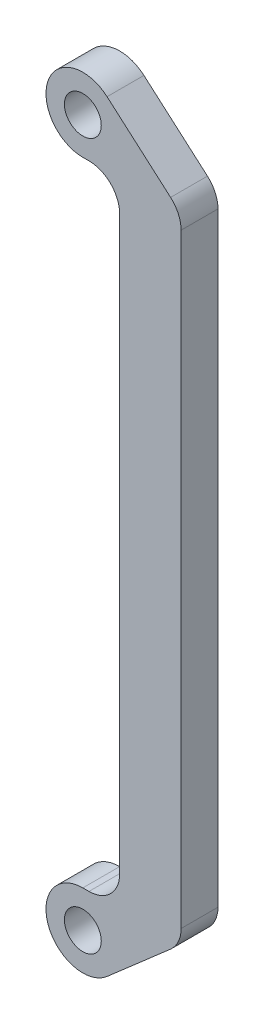
ISO-10303-21;
HEADER;
FILE_DESCRIPTION(('STEP AP214'),'2;1');
FILE_NAME('part.step','',(''),(''),'','','');
FILE_SCHEMA(('AUTOMOTIVE_DESIGN { 1 0 10303 214 1 1 1 1 }'));
ENDSEC;
DATA;
#1=APPLICATION_CONTEXT('core data for automotive mechanical design processes');
#2=APPLICATION_PROTOCOL_DEFINITION('international standard','automotive_design',2000,#1);
#3=PRODUCT_CONTEXT('',#1,'mechanical');
#4=PRODUCT('Part','Part','',(#3));
#5=PRODUCT_RELATED_PRODUCT_CATEGORY('part','',(#4));
#6=PRODUCT_DEFINITION_FORMATION('','',#4);
#7=PRODUCT_DEFINITION_CONTEXT('part definition',#1,'design');
#8=PRODUCT_DEFINITION('design','',#6,#7);
#9=PRODUCT_DEFINITION_SHAPE('','',#8);
#10=(LENGTH_UNIT() NAMED_UNIT(*) SI_UNIT(.MILLI.,.METRE.));
#11=(NAMED_UNIT(*) PLANE_ANGLE_UNIT() SI_UNIT($,.RADIAN.));
#12=(NAMED_UNIT(*) SI_UNIT($,.STERADIAN.) SOLID_ANGLE_UNIT());
#13=UNCERTAINTY_MEASURE_WITH_UNIT(LENGTH_MEASURE(1.E-05),#10,'distance_accuracy_value','');
#14=(GEOMETRIC_REPRESENTATION_CONTEXT(3) GLOBAL_UNCERTAINTY_ASSIGNED_CONTEXT((#13)) GLOBAL_UNIT_ASSIGNED_CONTEXT((#10,
#11,#12)) REPRESENTATION_CONTEXT('',''));
#15=CARTESIAN_POINT('',(0.,0.,0.));
#16=DIRECTION('',(0.,0.,1.));
#17=DIRECTION('',(1.,0.,0.));
#18=AXIS2_PLACEMENT_3D('',#15,#16,#17);
#19=CARTESIAN_POINT('',(0.,6.,6.));
#20=DIRECTION('',(0.,1.,0.));
#21=DIRECTION('',(0.,0.,1.));
#22=AXIS2_PLACEMENT_3D('',#19,#20,#21);
#23=PLANE('',#22);
#24=DIRECTION('',(1.,0.,0.));
#25=VECTOR('',#24,1.);
#26=CARTESIAN_POINT('',(0.,6.,0.));
#27=LINE('',#26,#25);
#28=CARTESIAN_POINT('',(0.,6.,0.));
#29=VERTEX_POINT('',#28);
#30=CARTESIAN_POINT('',(0.999999999999964,6.,0.));
#31=VERTEX_POINT('',#30);
#32=EDGE_CURVE('E157',#29,#31,#27,.T.);
#33=ORIENTED_EDGE('',*,*,#32,.F.);
#34=DIRECTION('',(0.,0.,-1.));
#35=VECTOR('',#34,1.);
#36=CARTESIAN_POINT('',(0.,6.,6.));
#37=LINE('',#36,#35);
#38=CARTESIAN_POINT('',(0.,6.,6.));
#39=VERTEX_POINT('',#38);
#40=EDGE_CURVE('E11',#39,#29,#37,.T.);
#41=ORIENTED_EDGE('',*,*,#40,.F.);
#42=DIRECTION('',(1.,0.,0.));
#43=VECTOR('',#42,1.);
#44=CARTESIAN_POINT('',(0.,6.,6.));
#45=LINE('',#44,#43);
#46=CARTESIAN_POINT('',(0.999999999999964,6.,6.));
#47=VERTEX_POINT('',#46);
#48=EDGE_CURVE('E193',#39,#47,#45,.T.);
#49=ORIENTED_EDGE('',*,*,#48,.T.);
#50=DIRECTION('',(0.,0.,-1.));
#51=VECTOR('',#50,1.);
#52=CARTESIAN_POINT('',(0.999999999999964,6.,6.));
#53=LINE('',#52,#51);
#54=EDGE_CURVE('E95',#47,#31,#53,.T.);
#55=ORIENTED_EDGE('',*,*,#54,.T.);
#56=EDGE_LOOP('',(#33,#41,#49,#55));
#57=FACE_BOUND('',#56,.T.);
#58=ADVANCED_FACE('F33',(#57),#23,.T.);
#59=CARTESIAN_POINT('',(0.,0.,6.));
#60=DIRECTION('',(0.,0.,-1.));
#61=DIRECTION('',(-1.,0.,0.));
#62=AXIS2_PLACEMENT_3D('',#59,#60,#61);
#63=CYLINDRICAL_SURFACE('',#62,6.);
#64=CARTESIAN_POINT('',(0.,0.,0.));
#65=DIRECTION('',(0.,0.,1.));
#66=DIRECTION('',(1.,0.,0.));
#67=AXIS2_PLACEMENT_3D('',#64,#65,#66);
#68=CIRCLE('',#67,6.);
#69=CARTESIAN_POINT('',(3.94520547945205,-4.52054794520548,0.));
#70=VERTEX_POINT('',#69);
#71=EDGE_CURVE('E160',#29,#70,#68,.T.);
#72=ORIENTED_EDGE('',*,*,#71,.T.);
#73=DIRECTION('',(0.,0.,-1.));
#74=VECTOR('',#73,1.);
#75=CARTESIAN_POINT('',(3.94520547945205,-4.52054794520548,6.));
#76=LINE('',#75,#74);
#77=CARTESIAN_POINT('',(3.94520547945205,-4.52054794520548,6.));
#78=VERTEX_POINT('',#77);
#79=EDGE_CURVE('E41',#78,#70,#76,.T.);
#80=ORIENTED_EDGE('',*,*,#79,.F.);
#81=CARTESIAN_POINT('',(0.,0.,6.));
#82=DIRECTION('',(0.,0.,1.));
#83=DIRECTION('',(1.,0.,0.));
#84=AXIS2_PLACEMENT_3D('',#81,#82,#83);
#85=CIRCLE('',#84,6.);
#86=EDGE_CURVE('E231',#39,#78,#85,.T.);
#87=ORIENTED_EDGE('',*,*,#86,.F.);
#88=ORIENTED_EDGE('',*,*,#40,.T.);
#89=EDGE_LOOP('',(#72,#80,#87,#88));
#90=FACE_BOUND('',#89,.T.);
#91=ADVANCED_FACE('F219',(#90),#63,.T.);
#92=CARTESIAN_POINT('',(3.94520547945205,-4.52054794520548,6.));
#93=DIRECTION('',(0.657534246575342,-0.753424657534247,0.));
#94=DIRECTION('',(0.753424657534247,0.657534246575342,0.));
#95=AXIS2_PLACEMENT_3D('',#92,#93,#94);
#96=PLANE('',#95);
#97=DIRECTION('',(-0.753424657534247,-0.657534246575342,0.));
#98=VECTOR('',#97,1.);
#99=CARTESIAN_POINT('',(3.94520547945205,-4.52054794520548,0.));
#100=LINE('',#99,#98);
#101=CARTESIAN_POINT('',(14.2876712328767,4.50560398505602,0.));
#102=VERTEX_POINT('',#101);
#103=EDGE_CURVE('E163',#102,#70,#100,.T.);
#104=ORIENTED_EDGE('',*,*,#103,.F.);
#105=DIRECTION('',(0.,0.,-1.));
#106=VECTOR('',#105,1.);
#107=CARTESIAN_POINT('',(14.2876712328767,4.50560398505602,6.));
#108=LINE('',#107,#106);
#109=CARTESIAN_POINT('',(14.2876712328767,4.50560398505602,6.));
#110=VERTEX_POINT('',#109);
#111=EDGE_CURVE('E209',#110,#102,#108,.T.);
#112=ORIENTED_EDGE('',*,*,#111,.F.);
#113=DIRECTION('',(-0.753424657534247,-0.657534246575342,0.));
#114=VECTOR('',#113,1.);
#115=CARTESIAN_POINT('',(3.94520547945205,-4.52054794520548,6.));
#116=LINE('',#115,#114);
#117=EDGE_CURVE('E216',#110,#78,#116,.T.);
#118=ORIENTED_EDGE('',*,*,#117,.T.);
#119=ORIENTED_EDGE('',*,*,#79,.T.);
#120=EDGE_LOOP('',(#104,#112,#118,#119));
#121=FACE_BOUND('',#120,.T.);
#122=ADVANCED_FACE('F214',(#121),#96,.T.);
#123=CARTESIAN_POINT('',(11.,8.27272727272727,6.));
#124=DIRECTION('',(0.,0.,-1.));
#125=DIRECTION('',(-1.,0.,0.));
#126=AXIS2_PLACEMENT_3D('',#123,#124,#125);
#127=CYLINDRICAL_SURFACE('',#126,5.);
#128=CARTESIAN_POINT('',(11.,8.27272727272727,0.));
#129=DIRECTION('',(0.,0.,1.));
#130=DIRECTION('',(1.,0.,0.));
#131=AXIS2_PLACEMENT_3D('',#128,#129,#130);
#132=CIRCLE('',#131,5.);
#133=CARTESIAN_POINT('',(16.,8.27272727272729,0.));
#134=VERTEX_POINT('',#133);
#135=EDGE_CURVE('E166',#134,#102,#132,.F.);
#136=ORIENTED_EDGE('',*,*,#135,.F.);
#137=DIRECTION('',(0.,0.,-1.));
#138=VECTOR('',#137,1.);
#139=CARTESIAN_POINT('',(16.,8.27272727272729,6.));
#140=LINE('',#139,#138);
#141=CARTESIAN_POINT('',(16.,8.27272727272729,6.));
#142=VERTEX_POINT('',#141);
#143=EDGE_CURVE('E207',#142,#134,#140,.T.);
#144=ORIENTED_EDGE('',*,*,#143,.F.);
#145=CARTESIAN_POINT('',(11.,8.27272727272727,6.));
#146=DIRECTION('',(0.,0.,1.));
#147=DIRECTION('',(1.,0.,0.));
#148=AXIS2_PLACEMENT_3D('',#145,#146,#147);
#149=CIRCLE('',#148,5.);
#150=EDGE_CURVE('E230',#142,#110,#149,.F.);
#151=ORIENTED_EDGE('',*,*,#150,.T.);
#152=ORIENTED_EDGE('',*,*,#111,.T.);
#153=EDGE_LOOP('',(#136,#144,#151,#152));
#154=FACE_BOUND('',#153,.T.);
#155=ADVANCED_FACE('F226',(#154),#127,.T.);
#156=CARTESIAN_POINT('',(16.,0.,6.));
#157=DIRECTION('',(-1.,0.,0.));
#158=DIRECTION('',(0.,-1.,0.));
#159=AXIS2_PLACEMENT_3D('',#156,#157,#158);
#160=PLANE('',#159);
#161=DIRECTION('',(0.,1.,0.));
#162=VECTOR('',#161,1.);
#163=CARTESIAN_POINT('',(16.,0.,0.));
#164=LINE('',#163,#162);
#165=CARTESIAN_POINT('',(16.,106.727272727273,0.));
#166=VERTEX_POINT('',#165);
#167=EDGE_CURVE('E169',#134,#166,#164,.T.);
#168=ORIENTED_EDGE('',*,*,#167,.T.);
#169=DIRECTION('',(0.,0.,-1.));
#170=VECTOR('',#169,1.);
#171=CARTESIAN_POINT('',(16.,106.727272727273,6.));
#172=LINE('',#171,#170);
#173=CARTESIAN_POINT('',(16.,106.727272727273,6.));
#174=VERTEX_POINT('',#173);
#175=EDGE_CURVE('E205',#174,#166,#172,.T.);
#176=ORIENTED_EDGE('',*,*,#175,.F.);
#177=DIRECTION('',(0.,1.,0.));
#178=VECTOR('',#177,1.);
#179=CARTESIAN_POINT('',(16.,0.,6.));
#180=LINE('',#179,#178);
#181=EDGE_CURVE('E233',#142,#174,#180,.T.);
#182=ORIENTED_EDGE('',*,*,#181,.F.);
#183=ORIENTED_EDGE('',*,*,#143,.T.);
#184=EDGE_LOOP('',(#168,#176,#182,#183));
#185=FACE_BOUND('',#184,.T.);
#186=ADVANCED_FACE('F268',(#185),#160,.F.);
#187=CARTESIAN_POINT('',(11.,106.727272727273,6.));
#188=DIRECTION('',(0.,0.,-1.));
#189=DIRECTION('',(-1.,0.,0.));
#190=AXIS2_PLACEMENT_3D('',#187,#188,#189);
#191=CYLINDRICAL_SURFACE('',#190,5.);
#192=CARTESIAN_POINT('',(11.,106.727272727273,0.));
#193=DIRECTION('',(0.,0.,1.));
#194=DIRECTION('',(1.,0.,0.));
#195=AXIS2_PLACEMENT_3D('',#192,#193,#194);
#196=CIRCLE('',#195,5.);
#197=CARTESIAN_POINT('',(14.2876712328767,110.494396014944,0.));
#198=VERTEX_POINT('',#197);
#199=EDGE_CURVE('E172',#198,#166,#196,.F.);
#200=ORIENTED_EDGE('',*,*,#199,.F.);
#201=DIRECTION('',(0.,0.,-1.));
#202=VECTOR('',#201,1.);
#203=CARTESIAN_POINT('',(14.2876712328767,110.494396014944,6.));
#204=LINE('',#203,#202);
#205=CARTESIAN_POINT('',(14.2876712328767,110.494396014944,6.));
#206=VERTEX_POINT('',#205);
#207=EDGE_CURVE('E203',#206,#198,#204,.T.);
#208=ORIENTED_EDGE('',*,*,#207,.F.);
#209=CARTESIAN_POINT('',(11.,106.727272727273,6.));
#210=DIRECTION('',(0.,0.,1.));
#211=DIRECTION('',(1.,0.,0.));
#212=AXIS2_PLACEMENT_3D('',#209,#210,#211);
#213=CIRCLE('',#212,5.);
#214=EDGE_CURVE('E239',#206,#174,#213,.F.);
#215=ORIENTED_EDGE('',*,*,#214,.T.);
#216=ORIENTED_EDGE('',*,*,#175,.T.);
#217=EDGE_LOOP('',(#200,#208,#215,#216));
#218=FACE_BOUND('',#217,.T.);
#219=ADVANCED_FACE('F271',(#218),#191,.T.);
#220=CARTESIAN_POINT('',(60.9164946519047,69.8001501219742,6.));
#221=DIRECTION('',(-0.657534246575342,-0.753424657534247,0.));
#222=DIRECTION('',(0.753424657534247,-0.657534246575342,0.));
#223=AXIS2_PLACEMENT_3D('',#220,#221,#222);
#224=PLANE('',#223);
#225=DIRECTION('',(-0.753424657534247,0.657534246575342,0.));
#226=VECTOR('',#225,1.);
#227=CARTESIAN_POINT('',(60.9164946519047,69.8001501219742,0.));
#228=LINE('',#227,#226);
#229=CARTESIAN_POINT('',(3.94520547945191,119.520547945206,0.));
#230=VERTEX_POINT('',#229);
#231=EDGE_CURVE('E175',#198,#230,#228,.T.);
#232=ORIENTED_EDGE('',*,*,#231,.T.);
#233=DIRECTION('',(0.,0.,-1.));
#234=VECTOR('',#233,1.);
#235=CARTESIAN_POINT('',(3.94520547945191,119.520547945206,6.));
#236=LINE('',#235,#234);
#237=CARTESIAN_POINT('',(3.94520547945191,119.520547945206,6.));
#238=VERTEX_POINT('',#237);
#239=EDGE_CURVE('E200',#238,#230,#236,.T.);
#240=ORIENTED_EDGE('',*,*,#239,.F.);
#241=DIRECTION('',(-0.753424657534247,0.657534246575342,0.));
#242=VECTOR('',#241,1.);
#243=CARTESIAN_POINT('',(60.9164946519047,69.8001501219742,6.));
#244=LINE('',#243,#242);
#245=EDGE_CURVE('E242',#206,#238,#244,.T.);
#246=ORIENTED_EDGE('',*,*,#245,.F.);
#247=ORIENTED_EDGE('',*,*,#207,.T.);
#248=EDGE_LOOP('',(#232,#240,#246,#247));
#249=FACE_BOUND('',#248,.T.);
#250=ADVANCED_FACE('F275',(#249),#224,.F.);
#251=CARTESIAN_POINT('',(0.,115.,6.));
#252=DIRECTION('',(0.,0.,-1.));
#253=DIRECTION('',(-1.,0.,0.));
#254=AXIS2_PLACEMENT_3D('',#251,#252,#253);
#255=CYLINDRICAL_SURFACE('',#254,6.);
#256=CARTESIAN_POINT('',(0.,115.,0.));
#257=DIRECTION('',(0.,0.,1.));
#258=DIRECTION('',(1.,0.,0.));
#259=AXIS2_PLACEMENT_3D('',#256,#257,#258);
#260=CIRCLE('',#259,6.);
#261=CARTESIAN_POINT('',(0.,109.,0.));
#262=VERTEX_POINT('',#261);
#263=EDGE_CURVE('E177',#230,#262,#260,.T.);
#264=ORIENTED_EDGE('',*,*,#263,.T.);
#265=DIRECTION('',(0.,0.,-1.));
#266=VECTOR('',#265,1.);
#267=CARTESIAN_POINT('',(0.,109.,6.));
#268=LINE('',#267,#266);
#269=CARTESIAN_POINT('',(0.,109.,6.));
#270=VERTEX_POINT('',#269);
#271=EDGE_CURVE('E197',#270,#262,#268,.T.);
#272=ORIENTED_EDGE('',*,*,#271,.F.);
#273=CARTESIAN_POINT('',(0.,115.,6.));
#274=DIRECTION('',(0.,0.,1.));
#275=DIRECTION('',(1.,0.,0.));
#276=AXIS2_PLACEMENT_3D('',#273,#274,#275);
#277=CIRCLE('',#276,6.);
#278=EDGE_CURVE('E244',#238,#270,#277,.T.);
#279=ORIENTED_EDGE('',*,*,#278,.F.);
#280=ORIENTED_EDGE('',*,*,#239,.T.);
#281=EDGE_LOOP('',(#264,#272,#279,#280));
#282=FACE_BOUND('',#281,.T.);
#283=ADVANCED_FACE('F251',(#282),#255,.T.);
#284=CARTESIAN_POINT('',(0.,109.,6.));
#285=DIRECTION('',(0.,1.,0.));
#286=DIRECTION('',(0.,0.,1.));
#287=AXIS2_PLACEMENT_3D('',#284,#285,#286);
#288=PLANE('',#287);
#289=DIRECTION('',(1.,0.,0.));
#290=VECTOR('',#289,1.);
#291=CARTESIAN_POINT('',(0.,109.,0.));
#292=LINE('',#291,#290);
#293=CARTESIAN_POINT('',(0.999999999999964,109.,0.));
#294=VERTEX_POINT('',#293);
#295=EDGE_CURVE('E179',#262,#294,#292,.T.);
#296=ORIENTED_EDGE('',*,*,#295,.T.);
#297=DIRECTION('',(0.,0.,-1.));
#298=VECTOR('',#297,1.);
#299=CARTESIAN_POINT('',(0.999999999999964,109.,6.));
#300=LINE('',#299,#298);
#301=CARTESIAN_POINT('',(0.999999999999964,109.,6.));
#302=VERTEX_POINT('',#301);
#303=EDGE_CURVE('E137',#302,#294,#300,.T.);
#304=ORIENTED_EDGE('',*,*,#303,.F.);
#305=DIRECTION('',(1.,0.,0.));
#306=VECTOR('',#305,1.);
#307=CARTESIAN_POINT('',(0.,109.,6.));
#308=LINE('',#307,#306);
#309=EDGE_CURVE('E143',#270,#302,#308,.T.);
#310=ORIENTED_EDGE('',*,*,#309,.F.);
#311=ORIENTED_EDGE('',*,*,#271,.T.);
#312=EDGE_LOOP('',(#296,#304,#310,#311));
#313=FACE_BOUND('',#312,.T.);
#314=ADVANCED_FACE('F255',(#313),#288,.F.);
#315=CARTESIAN_POINT('',(0.999999999999999,104.,6.));
#316=DIRECTION('',(0.,0.,-1.));
#317=DIRECTION('',(-1.,0.,0.));
#318=AXIS2_PLACEMENT_3D('',#315,#316,#317);
#319=CYLINDRICAL_SURFACE('',#318,5.);
#320=CARTESIAN_POINT('',(0.999999999999999,104.,0.));
#321=DIRECTION('',(0.,0.,1.));
#322=DIRECTION('',(1.,0.,0.));
#323=AXIS2_PLACEMENT_3D('',#320,#321,#322);
#324=CIRCLE('',#323,5.);
#325=CARTESIAN_POINT('',(6.,104.,0.));
#326=VERTEX_POINT('',#325);
#327=EDGE_CURVE('E132',#326,#294,#324,.T.);
#328=ORIENTED_EDGE('',*,*,#327,.F.);
#329=DIRECTION('',(0.,0.,-1.));
#330=VECTOR('',#329,1.);
#331=CARTESIAN_POINT('',(6.,104.,6.));
#332=LINE('',#331,#330);
#333=CARTESIAN_POINT('',(6.,104.,6.));
#334=VERTEX_POINT('',#333);
#335=EDGE_CURVE('E127',#334,#326,#332,.T.);
#336=ORIENTED_EDGE('',*,*,#335,.F.);
#337=CARTESIAN_POINT('',(0.999999999999999,104.,6.));
#338=DIRECTION('',(0.,0.,1.));
#339=DIRECTION('',(1.,0.,0.));
#340=AXIS2_PLACEMENT_3D('',#337,#338,#339);
#341=CIRCLE('',#340,5.);
#342=EDGE_CURVE('E130',#334,#302,#341,.T.);
#343=ORIENTED_EDGE('',*,*,#342,.T.);
#344=ORIENTED_EDGE('',*,*,#303,.T.);
#345=EDGE_LOOP('',(#328,#336,#343,#344));
#346=FACE_BOUND('',#345,.T.);
#347=ADVANCED_FACE('F129',(#346),#319,.F.);
#348=CARTESIAN_POINT('',(6.,0.,6.));
#349=DIRECTION('',(-1.,0.,0.));
#350=DIRECTION('',(0.,0.,1.));
#351=AXIS2_PLACEMENT_3D('',#348,#349,#350);
#352=PLANE('',#351);
#353=DIRECTION('',(0.,1.,0.));
#354=VECTOR('',#353,1.);
#355=CARTESIAN_POINT('',(6.,0.,0.));
#356=LINE('',#355,#354);
#357=CARTESIAN_POINT('',(6.,11.,0.));
#358=VERTEX_POINT('',#357);
#359=EDGE_CURVE('E183',#358,#326,#356,.T.);
#360=ORIENTED_EDGE('',*,*,#359,.F.);
#361=DIRECTION('',(0.,0.,-1.));
#362=VECTOR('',#361,1.);
#363=CARTESIAN_POINT('',(6.,11.,6.));
#364=LINE('',#363,#362);
#365=CARTESIAN_POINT('',(6.,11.,6.));
#366=VERTEX_POINT('',#365);
#367=EDGE_CURVE('E88',#366,#358,#364,.T.);
#368=ORIENTED_EDGE('',*,*,#367,.F.);
#369=DIRECTION('',(0.,1.,0.));
#370=VECTOR('',#369,1.);
#371=CARTESIAN_POINT('',(6.,0.,6.));
#372=LINE('',#371,#370);
#373=EDGE_CURVE('E141',#366,#334,#372,.T.);
#374=ORIENTED_EDGE('',*,*,#373,.T.);
#375=ORIENTED_EDGE('',*,*,#335,.T.);
#376=EDGE_LOOP('',(#360,#368,#374,#375));
#377=FACE_BOUND('',#376,.T.);
#378=ADVANCED_FACE('F146',(#377),#352,.T.);
#379=CARTESIAN_POINT('',(0.,0.,6.));
#380=DIRECTION('',(0.,0.,-1.));
#381=DIRECTION('',(-1.,0.,0.));
#382=AXIS2_PLACEMENT_3D('',#379,#380,#381);
#383=CYLINDRICAL_SURFACE('',#382,3.);
#384=CARTESIAN_POINT('',(0.,0.,6.));
#385=DIRECTION('',(0.,0.,1.));
#386=DIRECTION('',(1.,0.,0.));
#387=AXIS2_PLACEMENT_3D('',#384,#385,#386);
#388=CIRCLE('',#387,3.);
#389=CARTESIAN_POINT('',(3.,0.,6.));
#390=VERTEX_POINT('',#389);
#391=EDGE_CURVE('E148',#390,#390,#388,.T.);
#392=ORIENTED_EDGE('',*,*,#391,.T.);
#393=EDGE_LOOP('',(#392));
#394=FACE_BOUND('',#393,.T.);
#395=CARTESIAN_POINT('',(0.,0.,0.));
#396=DIRECTION('',(0.,0.,1.));
#397=DIRECTION('',(1.,0.,0.));
#398=AXIS2_PLACEMENT_3D('',#395,#396,#397);
#399=CIRCLE('',#398,3.);
#400=CARTESIAN_POINT('',(3.,0.,0.));
#401=VERTEX_POINT('',#400);
#402=EDGE_CURVE('E187',#401,#401,#399,.T.);
#403=ORIENTED_EDGE('',*,*,#402,.F.);
#404=EDGE_LOOP('',(#403));
#405=FACE_BOUND('',#404,.T.);
#406=ADVANCED_FACE('F288',(#394,#405),#383,.F.);
#407=CARTESIAN_POINT('',(1.,11.,6.));
#408=DIRECTION('',(0.,0.,-1.));
#409=DIRECTION('',(-1.,0.,0.));
#410=AXIS2_PLACEMENT_3D('',#407,#408,#409);
#411=CYLINDRICAL_SURFACE('',#410,5.);
#412=CARTESIAN_POINT('',(1.,11.,0.));
#413=DIRECTION('',(0.,0.,1.));
#414=DIRECTION('',(1.,0.,0.));
#415=AXIS2_PLACEMENT_3D('',#412,#413,#414);
#416=CIRCLE('',#415,5.);
#417=EDGE_CURVE('E185',#358,#31,#416,.F.);
#418=ORIENTED_EDGE('',*,*,#417,.T.);
#419=ORIENTED_EDGE('',*,*,#54,.F.);
#420=CARTESIAN_POINT('',(1.,11.,6.));
#421=DIRECTION('',(0.,0.,1.));
#422=DIRECTION('',(1.,0.,0.));
#423=AXIS2_PLACEMENT_3D('',#420,#421,#422);
#424=CIRCLE('',#423,5.);
#425=EDGE_CURVE('E49',#366,#47,#424,.F.);
#426=ORIENTED_EDGE('',*,*,#425,.F.);
#427=ORIENTED_EDGE('',*,*,#367,.T.);
#428=EDGE_LOOP('',(#418,#419,#426,#427));
#429=FACE_BOUND('',#428,.T.);
#430=ADVANCED_FACE('F256',(#429),#411,.F.);
#431=CARTESIAN_POINT('',(0.,115.,6.));
#432=DIRECTION('',(0.,0.,-1.));
#433=DIRECTION('',(-1.,0.,0.));
#434=AXIS2_PLACEMENT_3D('',#431,#432,#433);
#435=CYLINDRICAL_SURFACE('',#434,3.);
#436=CARTESIAN_POINT('',(0.,115.,6.));
#437=DIRECTION('',(0.,0.,1.));
#438=DIRECTION('',(1.,0.,0.));
#439=AXIS2_PLACEMENT_3D('',#436,#437,#438);
#440=CIRCLE('',#439,3.);
#441=CARTESIAN_POINT('',(3.,115.,6.));
#442=VERTEX_POINT('',#441);
#443=EDGE_CURVE('E154',#442,#442,#440,.T.);
#444=ORIENTED_EDGE('',*,*,#443,.T.);
#445=EDGE_LOOP('',(#444));
#446=FACE_BOUND('',#445,.T.);
#447=CARTESIAN_POINT('',(0.,115.,0.));
#448=DIRECTION('',(0.,0.,1.));
#449=DIRECTION('',(1.,0.,0.));
#450=AXIS2_PLACEMENT_3D('',#447,#448,#449);
#451=CIRCLE('',#450,3.);
#452=CARTESIAN_POINT('',(3.,115.,0.));
#453=VERTEX_POINT('',#452);
#454=EDGE_CURVE('E190',#453,#453,#451,.T.);
#455=ORIENTED_EDGE('',*,*,#454,.F.);
#456=EDGE_LOOP('',(#455));
#457=FACE_BOUND('',#456,.T.);
#458=ADVANCED_FACE('F291',(#446,#457),#435,.F.);
#459=CARTESIAN_POINT('',(0.,0.,6.));
#460=DIRECTION('',(0.,0.,1.));
#461=DIRECTION('',(1.,0.,0.));
#462=AXIS2_PLACEMENT_3D('',#459,#460,#461);
#463=PLANE('',#462);
#464=ORIENTED_EDGE('',*,*,#48,.F.);
#465=ORIENTED_EDGE('',*,*,#86,.T.);
#466=ORIENTED_EDGE('',*,*,#117,.F.);
#467=ORIENTED_EDGE('',*,*,#150,.F.);
#468=ORIENTED_EDGE('',*,*,#181,.T.);
#469=ORIENTED_EDGE('',*,*,#214,.F.);
#470=ORIENTED_EDGE('',*,*,#245,.T.);
#471=ORIENTED_EDGE('',*,*,#278,.T.);
#472=ORIENTED_EDGE('',*,*,#309,.T.);
#473=ORIENTED_EDGE('',*,*,#342,.F.);
#474=ORIENTED_EDGE('',*,*,#373,.F.);
#475=ORIENTED_EDGE('',*,*,#425,.T.);
#476=EDGE_LOOP('',(#464,#465,#466,#467,#468,#469,#470,#471,#472,#473,#474,#475));
#477=FACE_BOUND('',#476,.T.);
#478=ORIENTED_EDGE('',*,*,#391,.F.);
#479=EDGE_LOOP('',(#478));
#480=FACE_BOUND('',#479,.T.);
#481=ORIENTED_EDGE('',*,*,#443,.F.);
#482=EDGE_LOOP('',(#481));
#483=FACE_BOUND('',#482,.T.);
#484=ADVANCED_FACE('F139',(#477,#480,#483),#463,.T.);
#485=CARTESIAN_POINT('',(0.,0.,0.));
#486=DIRECTION('',(0.,0.,1.));
#487=DIRECTION('',(1.,0.,0.));
#488=AXIS2_PLACEMENT_3D('',#485,#486,#487);
#489=PLANE('',#488);
#490=ORIENTED_EDGE('',*,*,#32,.T.);
#491=ORIENTED_EDGE('',*,*,#417,.F.);
#492=ORIENTED_EDGE('',*,*,#359,.T.);
#493=ORIENTED_EDGE('',*,*,#327,.T.);
#494=ORIENTED_EDGE('',*,*,#295,.F.);
#495=ORIENTED_EDGE('',*,*,#263,.F.);
#496=ORIENTED_EDGE('',*,*,#231,.F.);
#497=ORIENTED_EDGE('',*,*,#199,.T.);
#498=ORIENTED_EDGE('',*,*,#167,.F.);
#499=ORIENTED_EDGE('',*,*,#135,.T.);
#500=ORIENTED_EDGE('',*,*,#103,.T.);
#501=ORIENTED_EDGE('',*,*,#71,.F.);
#502=EDGE_LOOP('',(#490,#491,#492,#493,#494,#495,#496,#497,#498,#499,#500,#501));
#503=FACE_BOUND('',#502,.T.);
#504=ORIENTED_EDGE('',*,*,#402,.T.);
#505=EDGE_LOOP('',(#504));
#506=FACE_BOUND('',#505,.T.);
#507=ORIENTED_EDGE('',*,*,#454,.T.);
#508=EDGE_LOOP('',(#507));
#509=FACE_BOUND('',#508,.T.);
#510=ADVANCED_FACE('F221',(#503,#506,#509),#489,.F.);
#511=CLOSED_SHELL('',(#58,#91,#122,#155,#186,#219,#250,#283,#314,#347,#378,#406,#430,#458,#484,#510));
#512=MANIFOLD_SOLID_BREP('B2',#511);
#513=ADVANCED_BREP_SHAPE_REPRESENTATION('',(#18,#512),#14);
#514=SHAPE_DEFINITION_REPRESENTATION(#9,#513);
ENDSEC;
END-ISO-10303-21;
